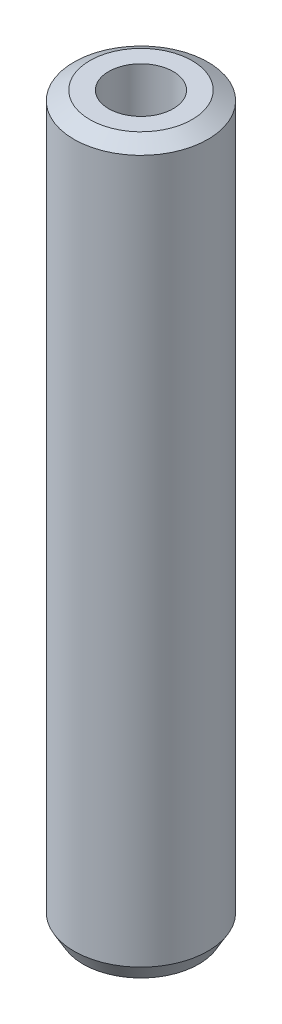
ISO-10303-21;
HEADER;
FILE_DESCRIPTION(('STEP AP214'),'2;1');
FILE_NAME('part.step','',(''),(''),'','','');
FILE_SCHEMA(('AUTOMOTIVE_DESIGN { 1 0 10303 214 1 1 1 1 }'));
ENDSEC;
DATA;
#1=APPLICATION_CONTEXT('core data for automotive mechanical design processes');
#2=APPLICATION_PROTOCOL_DEFINITION('international standard','automotive_design',2000,#1);
#3=PRODUCT_CONTEXT('',#1,'mechanical');
#4=PRODUCT('Part','Part','',(#3));
#5=PRODUCT_RELATED_PRODUCT_CATEGORY('part','',(#4));
#6=PRODUCT_DEFINITION_FORMATION('','',#4);
#7=PRODUCT_DEFINITION_CONTEXT('part definition',#1,'design');
#8=PRODUCT_DEFINITION('design','',#6,#7);
#9=PRODUCT_DEFINITION_SHAPE('','',#8);
#10=(LENGTH_UNIT() NAMED_UNIT(*) SI_UNIT(.MILLI.,.METRE.));
#11=(NAMED_UNIT(*) PLANE_ANGLE_UNIT() SI_UNIT($,.RADIAN.));
#12=(NAMED_UNIT(*) SI_UNIT($,.STERADIAN.) SOLID_ANGLE_UNIT());
#13=UNCERTAINTY_MEASURE_WITH_UNIT(LENGTH_MEASURE(1.E-05),#10,'distance_accuracy_value','');
#14=(GEOMETRIC_REPRESENTATION_CONTEXT(3) GLOBAL_UNCERTAINTY_ASSIGNED_CONTEXT((#13)) GLOBAL_UNIT_ASSIGNED_CONTEXT((#10,
#11,#12)) REPRESENTATION_CONTEXT('',''));
#15=CARTESIAN_POINT('',(0.,0.,0.));
#16=DIRECTION('',(0.,0.,1.));
#17=DIRECTION('',(1.,0.,0.));
#18=AXIS2_PLACEMENT_3D('',#15,#16,#17);
#19=CARTESIAN_POINT('',(0.,380.457695246652,0.));
#20=DIRECTION('',(0.,-1.,0.));
#21=DIRECTION('',(0.,0.,-1.));
#22=AXIS2_PLACEMENT_3D('',#19,#20,#21);
#23=CYLINDRICAL_SURFACE('',#22,35.);
#24=CARTESIAN_POINT('',(0.,375.669450611703,0.));
#25=DIRECTION('',(0.,1.,0.));
#26=DIRECTION('',(0.,0.,1.));
#27=AXIS2_PLACEMENT_3D('',#24,#25,#26);
#28=CIRCLE('',#27,35.);
#29=CARTESIAN_POINT('',(0.,375.669450611703,35.));
#30=VERTEX_POINT('',#29);
#31=EDGE_CURVE('E50',#30,#30,#28,.F.);
#32=ORIENTED_EDGE('',*,*,#31,.T.);
#33=EDGE_LOOP('',(#32));
#34=FACE_BOUND('',#33,.T.);
#35=CARTESIAN_POINT('',(0.,8.29348298680044,0.));
#36=DIRECTION('',(0.,1.,0.));
#37=DIRECTION('',(0.,0.,1.));
#38=AXIS2_PLACEMENT_3D('',#35,#36,#37);
#39=CIRCLE('',#38,35.);
#40=CARTESIAN_POINT('',(0.,8.29348298680044,35.));
#41=VERTEX_POINT('',#40);
#42=EDGE_CURVE('E51',#41,#41,#39,.T.);
#43=ORIENTED_EDGE('',*,*,#42,.T.);
#44=EDGE_LOOP('',(#43));
#45=FACE_BOUND('',#44,.T.);
#46=ADVANCED_FACE('F39',(#34,#45),#23,.T.);
#47=CARTESIAN_POINT('',(0.,380.457695246652,0.));
#48=DIRECTION('',(0.,1.,0.));
#49=DIRECTION('',(0.,0.,1.));
#50=AXIS2_PLACEMENT_3D('',#47,#48,#49);
#51=PLANE('',#50);
#52=CARTESIAN_POINT('',(0.,380.457695246652,0.));
#53=DIRECTION('',(0.,1.,0.));
#54=DIRECTION('',(0.,0.,1.));
#55=AXIS2_PLACEMENT_3D('',#52,#53,#54);
#56=CIRCLE('',#55,26.7065170131996);
#57=CARTESIAN_POINT('',(0.,380.457695246652,26.7065170131996));
#58=VERTEX_POINT('',#57);
#59=EDGE_CURVE('E54',#58,#58,#56,.T.);
#60=ORIENTED_EDGE('',*,*,#59,.T.);
#61=EDGE_LOOP('',(#60));
#62=FACE_BOUND('',#61,.T.);
#63=CARTESIAN_POINT('',(0.,380.457695246652,0.));
#64=DIRECTION('',(0.,1.,0.));
#65=DIRECTION('',(0.,0.,1.));
#66=AXIS2_PLACEMENT_3D('',#63,#64,#65);
#67=CIRCLE('',#66,16.860405679586);
#68=CARTESIAN_POINT('',(0.,380.457695246652,16.860405679586));
#69=VERTEX_POINT('',#68);
#70=EDGE_CURVE('E58',#69,#69,#67,.T.);
#71=ORIENTED_EDGE('',*,*,#70,.F.);
#72=EDGE_LOOP('',(#71));
#73=FACE_BOUND('',#72,.T.);
#74=ADVANCED_FACE('F69',(#62,#73),#51,.T.);
#75=CARTESIAN_POINT('',(0.,0.,0.));
#76=DIRECTION('',(0.,1.,0.));
#77=DIRECTION('',(0.,0.,1.));
#78=AXIS2_PLACEMENT_3D('',#75,#76,#77);
#79=PLANE('',#78);
#80=CARTESIAN_POINT('',(0.,0.,0.));
#81=DIRECTION('',(0.,1.,0.));
#82=DIRECTION('',(0.,0.,1.));
#83=AXIS2_PLACEMENT_3D('',#80,#81,#82);
#84=CIRCLE('',#83,30.2117553650512);
#85=CARTESIAN_POINT('',(0.,0.,30.2117553650512));
#86=VERTEX_POINT('',#85);
#87=EDGE_CURVE('E10',#86,#86,#84,.F.);
#88=ORIENTED_EDGE('',*,*,#87,.T.);
#89=EDGE_LOOP('',(#88));
#90=FACE_BOUND('',#89,.T.);
#91=CARTESIAN_POINT('',(0.,0.,0.));
#92=DIRECTION('',(0.,1.,0.));
#93=DIRECTION('',(0.,0.,1.));
#94=AXIS2_PLACEMENT_3D('',#91,#92,#93);
#95=CIRCLE('',#94,16.860405679586);
#96=CARTESIAN_POINT('',(0.,0.,16.860405679586));
#97=VERTEX_POINT('',#96);
#98=EDGE_CURVE('E63',#97,#97,#95,.T.);
#99=ORIENTED_EDGE('',*,*,#98,.T.);
#100=EDGE_LOOP('',(#99));
#101=FACE_BOUND('',#100,.T.);
#102=ADVANCED_FACE('F75',(#90,#101),#79,.F.);
#103=CARTESIAN_POINT('',(0.,380.457695246652,0.));
#104=DIRECTION('',(0.,-1.,0.));
#105=DIRECTION('',(0.,0.,-1.));
#106=AXIS2_PLACEMENT_3D('',#103,#104,#105);
#107=CYLINDRICAL_SURFACE('',#106,16.860405679586);
#108=ORIENTED_EDGE('',*,*,#70,.T.);
#109=EDGE_LOOP('',(#108));
#110=FACE_BOUND('',#109,.T.);
#111=ORIENTED_EDGE('',*,*,#98,.F.);
#112=EDGE_LOOP('',(#111));
#113=FACE_BOUND('',#112,.T.);
#114=ADVANCED_FACE('F70',(#110,#113),#107,.F.);
#115=CARTESIAN_POINT('',(0.,380.457695246652,0.));
#116=DIRECTION('',(0.,-1.,0.));
#117=DIRECTION('',(0.,0.,-1.));
#118=AXIS2_PLACEMENT_3D('',#115,#116,#117);
#119=CONICAL_SURFACE('',#118,26.7065170131996,1.04719755119659);
#120=ORIENTED_EDGE('',*,*,#31,.F.);
#121=EDGE_LOOP('',(#120));
#122=FACE_BOUND('',#121,.T.);
#123=ORIENTED_EDGE('',*,*,#59,.F.);
#124=EDGE_LOOP('',(#123));
#125=FACE_BOUND('',#124,.T.);
#126=ADVANCED_FACE('F81',(#122,#125),#119,.T.);
#127=CARTESIAN_POINT('',(0.,8.29348298680044,0.));
#128=DIRECTION('',(0.,1.,0.));
#129=DIRECTION('',(0.,0.,1.));
#130=AXIS2_PLACEMENT_3D('',#127,#128,#129);
#131=CONICAL_SURFACE('',#130,35.,0.523598775598302);
#132=ORIENTED_EDGE('',*,*,#87,.F.);
#133=EDGE_LOOP('',(#132));
#134=FACE_BOUND('',#133,.T.);
#135=ORIENTED_EDGE('',*,*,#42,.F.);
#136=EDGE_LOOP('',(#135));
#137=FACE_BOUND('',#136,.T.);
#138=ADVANCED_FACE('F45',(#134,#137),#131,.T.);
#139=CLOSED_SHELL('',(#46,#74,#102,#114,#126,#138));
#140=MANIFOLD_SOLID_BREP('B2',#139);
#141=ADVANCED_BREP_SHAPE_REPRESENTATION('',(#18,#140),#14);
#142=SHAPE_DEFINITION_REPRESENTATION(#9,#141);
ENDSEC;
END-ISO-10303-21;
